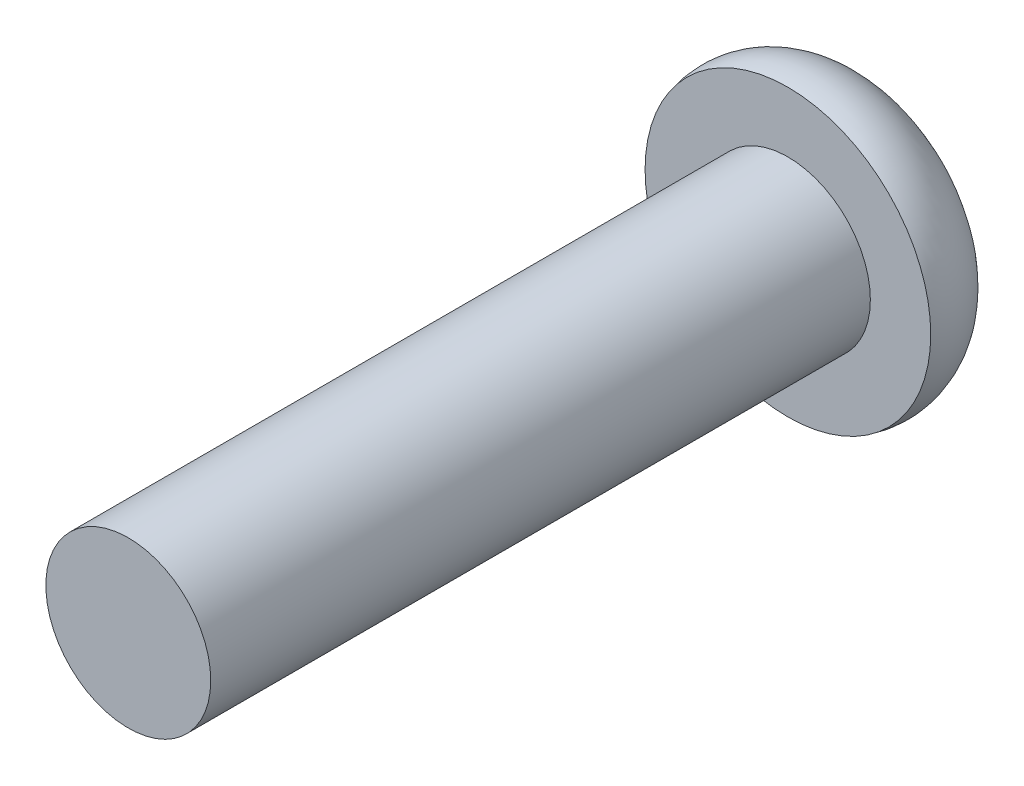
ISO-10303-21;
HEADER;
FILE_DESCRIPTION(('STEP AP214'),'2;1');
FILE_NAME('part.step','',(''),(''),'','','');
FILE_SCHEMA(('AUTOMOTIVE_DESIGN { 1 0 10303 214 1 1 1 1 }'));
ENDSEC;
DATA;
#1=APPLICATION_CONTEXT('core data for automotive mechanical design processes');
#2=APPLICATION_PROTOCOL_DEFINITION('international standard','automotive_design',2000,#1);
#3=PRODUCT_CONTEXT('',#1,'mechanical');
#4=PRODUCT('Part','Part','',(#3));
#5=PRODUCT_RELATED_PRODUCT_CATEGORY('part','',(#4));
#6=PRODUCT_DEFINITION_FORMATION('','',#4);
#7=PRODUCT_DEFINITION_CONTEXT('part definition',#1,'design');
#8=PRODUCT_DEFINITION('design','',#6,#7);
#9=PRODUCT_DEFINITION_SHAPE('','',#8);
#10=(LENGTH_UNIT() NAMED_UNIT(*) SI_UNIT(.MILLI.,.METRE.));
#11=(NAMED_UNIT(*) PLANE_ANGLE_UNIT() SI_UNIT($,.RADIAN.));
#12=(NAMED_UNIT(*) SI_UNIT($,.STERADIAN.) SOLID_ANGLE_UNIT());
#13=UNCERTAINTY_MEASURE_WITH_UNIT(LENGTH_MEASURE(1.E-05),#10,'distance_accuracy_value','');
#14=(GEOMETRIC_REPRESENTATION_CONTEXT(3) GLOBAL_UNCERTAINTY_ASSIGNED_CONTEXT((#13)) GLOBAL_UNIT_ASSIGNED_CONTEXT((#10,
#11,#12)) REPRESENTATION_CONTEXT('',''));
#15=CARTESIAN_POINT('',(0.,0.,0.));
#16=DIRECTION('',(0.,0.,1.));
#17=DIRECTION('',(1.,0.,0.));
#18=AXIS2_PLACEMENT_3D('',#15,#16,#17);
#19=CARTESIAN_POINT('',(0.,0.,0.));
#20=DIRECTION('',(0.,0.,-1.));
#21=DIRECTION('',(-1.,0.,0.));
#22=AXIS2_PLACEMENT_3D('',#19,#20,#21);
#23=PLANE('',#22);
#24=CARTESIAN_POINT('',(0.,0.,0.));
#25=DIRECTION('',(0.,0.,1.));
#26=DIRECTION('',(1.,0.,0.));
#27=AXIS2_PLACEMENT_3D('',#24,#25,#26);
#28=CIRCLE('',#27,3.175);
#29=CARTESIAN_POINT('',(3.175,0.,0.));
#30=VERTEX_POINT('',#29);
#31=EDGE_CURVE('E11',#30,#30,#28,.T.);
#32=ORIENTED_EDGE('',*,*,#31,.T.);
#33=EDGE_LOOP('',(#32));
#34=FACE_BOUND('',#33,.T.);
#35=ADVANCED_FACE('F32',(#34),#23,.F.);
#36=CARTESIAN_POINT('',(0.,0.,0.));
#37=DIRECTION('',(0.,0.,1.));
#38=DIRECTION('',(1.,0.,0.));
#39=AXIS2_PLACEMENT_3D('',#36,#37,#38);
#40=CYLINDRICAL_SURFACE('',#39,3.175);
#41=ORIENTED_EDGE('',*,*,#31,.F.);
#42=EDGE_LOOP('',(#41));
#43=FACE_BOUND('',#42,.T.);
#44=CARTESIAN_POINT('',(0.,0.,-25.4));
#45=DIRECTION('',(0.,0.,1.));
#46=DIRECTION('',(1.,0.,0.));
#47=AXIS2_PLACEMENT_3D('',#44,#45,#46);
#48=CIRCLE('',#47,3.175);
#49=CARTESIAN_POINT('',(3.175,0.,-25.4));
#50=VERTEX_POINT('',#49);
#51=EDGE_CURVE('E39',#50,#50,#48,.T.);
#52=ORIENTED_EDGE('',*,*,#51,.T.);
#53=EDGE_LOOP('',(#52));
#54=FACE_BOUND('',#53,.T.);
#55=ADVANCED_FACE('F146',(#43,#54),#40,.T.);
#56=CARTESIAN_POINT('',(-3.175,0.,-25.4));
#57=DIRECTION('',(0.,0.,-1.));
#58=DIRECTION('',(-1.,0.,0.));
#59=AXIS2_PLACEMENT_3D('',#56,#57,#58);
#60=PLANE('',#59);
#61=ORIENTED_EDGE('',*,*,#51,.F.);
#62=EDGE_LOOP('',(#61));
#63=FACE_BOUND('',#62,.T.);
#64=CARTESIAN_POINT('',(0.,0.,-25.4));
#65=DIRECTION('',(0.,0.,1.));
#66=DIRECTION('',(1.,0.,0.));
#67=AXIS2_PLACEMENT_3D('',#64,#65,#66);
#68=CIRCLE('',#67,5.5);
#69=CARTESIAN_POINT('',(5.5,0.,-25.4));
#70=VERTEX_POINT('',#69);
#71=EDGE_CURVE('E141',#70,#70,#68,.T.);
#72=ORIENTED_EDGE('',*,*,#71,.T.);
#73=EDGE_LOOP('',(#72));
#74=FACE_BOUND('',#73,.T.);
#75=ADVANCED_FACE('F148',(#63,#74),#60,.F.);
#76=CARTESIAN_POINT('',(0.,0.,-26.0634615384615));
#77=DIRECTION('',(0.,0.,1.));
#78=DIRECTION('',(1.,0.,0.));
#79=AXIS2_PLACEMENT_3D('',#76,#77,#78);
#80=TOROIDAL_SURFACE('',#79,3.,2.58653846153846);
#81=ORIENTED_EDGE('',*,*,#71,.F.);
#82=EDGE_LOOP('',(#81));
#83=FACE_BOUND('',#82,.T.);
#84=CARTESIAN_POINT('',(0.,0.,-28.65));
#85=DIRECTION('',(0.,0.,1.));
#86=DIRECTION('',(1.,0.,0.));
#87=AXIS2_PLACEMENT_3D('',#84,#85,#86);
#88=CIRCLE('',#87,3.);
#89=CARTESIAN_POINT('',(3.,0.,-28.65));
#90=VERTEX_POINT('',#89);
#91=EDGE_CURVE('E133',#90,#90,#88,.T.);
#92=ORIENTED_EDGE('',*,*,#91,.T.);
#93=EDGE_LOOP('',(#92));
#94=FACE_BOUND('',#93,.T.);
#95=ADVANCED_FACE('F151',(#83,#94),#80,.T.);
#96=CARTESIAN_POINT('',(-3.,0.,-28.65));
#97=DIRECTION('',(0.,0.,1.));
#98=DIRECTION('',(1.,0.,0.));
#99=AXIS2_PLACEMENT_3D('',#96,#97,#98);
#100=PLANE('',#99);
#101=DIRECTION('',(-0.866025403784439,0.5,0.));
#102=VECTOR('',#101,1.);
#103=CARTESIAN_POINT('',(0.,-2.3094010767585,-28.65));
#104=LINE('',#103,#102);
#105=CARTESIAN_POINT('',(0.,-2.3094010767585,-28.65));
#106=VERTEX_POINT('',#105);
#107=CARTESIAN_POINT('',(-2.,-1.15470053837925,-28.65));
#108=VERTEX_POINT('',#107);
#109=EDGE_CURVE('E120',#106,#108,#104,.T.);
#110=ORIENTED_EDGE('',*,*,#109,.F.);
#111=DIRECTION('',(-0.866025403784438,-0.5,0.));
#112=VECTOR('',#111,1.);
#113=CARTESIAN_POINT('',(2.,-1.15470053837925,-28.65));
#114=LINE('',#113,#112);
#115=CARTESIAN_POINT('',(2.,-1.15470053837925,-28.65));
#116=VERTEX_POINT('',#115);
#117=EDGE_CURVE('E46',#116,#106,#114,.T.);
#118=ORIENTED_EDGE('',*,*,#117,.F.);
#119=DIRECTION('',(0.,-1.,0.));
#120=VECTOR('',#119,1.);
#121=CARTESIAN_POINT('',(2.,1.15470053837925,-28.65));
#122=LINE('',#121,#120);
#123=CARTESIAN_POINT('',(2.,1.15470053837925,-28.65));
#124=VERTEX_POINT('',#123);
#125=EDGE_CURVE('E129',#124,#116,#122,.T.);
#126=ORIENTED_EDGE('',*,*,#125,.F.);
#127=DIRECTION('',(0.866025403784439,-0.5,0.));
#128=VECTOR('',#127,1.);
#129=CARTESIAN_POINT('',(0.,2.3094010767585,-28.65));
#130=LINE('',#129,#128);
#131=CARTESIAN_POINT('',(0.,2.3094010767585,-28.65));
#132=VERTEX_POINT('',#131);
#133=EDGE_CURVE('E127',#132,#124,#130,.T.);
#134=ORIENTED_EDGE('',*,*,#133,.F.);
#135=DIRECTION('',(0.866025403784439,0.5,0.));
#136=VECTOR('',#135,1.);
#137=CARTESIAN_POINT('',(-2.,1.15470053837925,-28.65));
#138=LINE('',#137,#136);
#139=CARTESIAN_POINT('',(-2.,1.15470053837925,-28.65));
#140=VERTEX_POINT('',#139);
#141=EDGE_CURVE('E94',#140,#132,#138,.T.);
#142=ORIENTED_EDGE('',*,*,#141,.F.);
#143=DIRECTION('',(0.,1.,0.));
#144=VECTOR('',#143,1.);
#145=CARTESIAN_POINT('',(-2.,-1.15470053837925,-28.65));
#146=LINE('',#145,#144);
#147=EDGE_CURVE('E123',#108,#140,#146,.T.);
#148=ORIENTED_EDGE('',*,*,#147,.F.);
#149=EDGE_LOOP('',(#110,#118,#126,#134,#142,#148));
#150=FACE_BOUND('',#149,.T.);
#151=ORIENTED_EDGE('',*,*,#91,.F.);
#152=EDGE_LOOP('',(#151));
#153=FACE_BOUND('',#152,.T.);
#154=ADVANCED_FACE('F157',(#150,#153),#100,.F.);
#155=CARTESIAN_POINT('',(2.,-1.15470053837925,-25.4));
#156=DIRECTION('',(0.5,-0.866025403784438,0.));
#157=DIRECTION('',(0.866025403784439,0.5,0.));
#158=AXIS2_PLACEMENT_3D('',#155,#156,#157);
#159=PLANE('',#158);
#160=ORIENTED_EDGE('',*,*,#117,.T.);
#161=DIRECTION('',(0.,0.,-1.));
#162=VECTOR('',#161,1.);
#163=CARTESIAN_POINT('',(0.,-2.3094010767585,-25.4));
#164=LINE('',#163,#162);
#165=CARTESIAN_POINT('',(0.,-2.3094010767585,-25.4));
#166=VERTEX_POINT('',#165);
#167=EDGE_CURVE('E76',#166,#106,#164,.T.);
#168=ORIENTED_EDGE('',*,*,#167,.F.);
#169=DIRECTION('',(-0.866025403784438,-0.5,0.));
#170=VECTOR('',#169,1.);
#171=CARTESIAN_POINT('',(2.,-1.15470053837925,-25.4));
#172=LINE('',#171,#170);
#173=CARTESIAN_POINT('',(2.,-1.15470053837925,-25.4));
#174=VERTEX_POINT('',#173);
#175=EDGE_CURVE('E131',#174,#166,#172,.T.);
#176=ORIENTED_EDGE('',*,*,#175,.F.);
#177=DIRECTION('',(0.,0.,-1.));
#178=VECTOR('',#177,1.);
#179=CARTESIAN_POINT('',(2.,-1.15470053837925,-25.4));
#180=LINE('',#179,#178);
#181=EDGE_CURVE('E54',#174,#116,#180,.T.);
#182=ORIENTED_EDGE('',*,*,#181,.T.);
#183=EDGE_LOOP('',(#160,#168,#176,#182));
#184=FACE_BOUND('',#183,.T.);
#185=ADVANCED_FACE('F162',(#184),#159,.F.);
#186=CARTESIAN_POINT('',(2.,1.15470053837925,-25.4));
#187=DIRECTION('',(1.,0.,0.));
#188=DIRECTION('',(0.,1.,0.));
#189=AXIS2_PLACEMENT_3D('',#186,#187,#188);
#190=PLANE('',#189);
#191=ORIENTED_EDGE('',*,*,#125,.T.);
#192=ORIENTED_EDGE('',*,*,#181,.F.);
#193=DIRECTION('',(0.,-1.,0.));
#194=VECTOR('',#193,1.);
#195=CARTESIAN_POINT('',(2.,1.15470053837925,-25.4));
#196=LINE('',#195,#194);
#197=CARTESIAN_POINT('',(2.,1.15470053837925,-25.4));
#198=VERTEX_POINT('',#197);
#199=EDGE_CURVE('E106',#198,#174,#196,.T.);
#200=ORIENTED_EDGE('',*,*,#199,.F.);
#201=DIRECTION('',(0.,0.,-1.));
#202=VECTOR('',#201,1.);
#203=CARTESIAN_POINT('',(2.,1.15470053837925,-25.4));
#204=LINE('',#203,#202);
#205=EDGE_CURVE('E98',#198,#124,#204,.T.);
#206=ORIENTED_EDGE('',*,*,#205,.T.);
#207=EDGE_LOOP('',(#191,#192,#200,#206));
#208=FACE_BOUND('',#207,.T.);
#209=ADVANCED_FACE('F168',(#208),#190,.F.);
#210=CARTESIAN_POINT('',(0.,2.3094010767585,-25.4));
#211=DIRECTION('',(0.5,0.866025403784439,0.));
#212=DIRECTION('',(-0.866025403784439,0.5,0.));
#213=AXIS2_PLACEMENT_3D('',#210,#211,#212);
#214=PLANE('',#213);
#215=ORIENTED_EDGE('',*,*,#133,.T.);
#216=ORIENTED_EDGE('',*,*,#205,.F.);
#217=DIRECTION('',(0.866025403784439,-0.5,0.));
#218=VECTOR('',#217,1.);
#219=CARTESIAN_POINT('',(0.,2.3094010767585,-25.4));
#220=LINE('',#219,#218);
#221=CARTESIAN_POINT('',(0.,2.3094010767585,-25.4));
#222=VERTEX_POINT('',#221);
#223=EDGE_CURVE('E102',#222,#198,#220,.T.);
#224=ORIENTED_EDGE('',*,*,#223,.F.);
#225=DIRECTION('',(0.,0.,-1.));
#226=VECTOR('',#225,1.);
#227=CARTESIAN_POINT('',(0.,2.3094010767585,-25.4));
#228=LINE('',#227,#226);
#229=EDGE_CURVE('E87',#222,#132,#228,.T.);
#230=ORIENTED_EDGE('',*,*,#229,.T.);
#231=EDGE_LOOP('',(#215,#216,#224,#230));
#232=FACE_BOUND('',#231,.T.);
#233=ADVANCED_FACE('F103',(#232),#214,.F.);
#234=CARTESIAN_POINT('',(-2.,1.15470053837925,-25.4));
#235=DIRECTION('',(-0.5,0.866025403784438,0.));
#236=DIRECTION('',(-0.866025403784439,-0.5,0.));
#237=AXIS2_PLACEMENT_3D('',#234,#235,#236);
#238=PLANE('',#237);
#239=ORIENTED_EDGE('',*,*,#141,.T.);
#240=ORIENTED_EDGE('',*,*,#229,.F.);
#241=DIRECTION('',(0.866025403784439,0.5,0.));
#242=VECTOR('',#241,1.);
#243=CARTESIAN_POINT('',(-2.,1.15470053837925,-25.4));
#244=LINE('',#243,#242);
#245=CARTESIAN_POINT('',(-2.,1.15470053837925,-25.4));
#246=VERTEX_POINT('',#245);
#247=EDGE_CURVE('E91',#246,#222,#244,.T.);
#248=ORIENTED_EDGE('',*,*,#247,.F.);
#249=DIRECTION('',(0.,0.,-1.));
#250=VECTOR('',#249,1.);
#251=CARTESIAN_POINT('',(-2.,1.15470053837925,-25.4));
#252=LINE('',#251,#250);
#253=EDGE_CURVE('E99',#246,#140,#252,.T.);
#254=ORIENTED_EDGE('',*,*,#253,.T.);
#255=EDGE_LOOP('',(#239,#240,#248,#254));
#256=FACE_BOUND('',#255,.T.);
#257=ADVANCED_FACE('F89',(#256),#238,.F.);
#258=CARTESIAN_POINT('',(-2.,-1.15470053837925,-25.4));
#259=DIRECTION('',(-1.,0.,0.));
#260=DIRECTION('',(0.,-1.,0.));
#261=AXIS2_PLACEMENT_3D('',#258,#259,#260);
#262=PLANE('',#261);
#263=ORIENTED_EDGE('',*,*,#147,.T.);
#264=ORIENTED_EDGE('',*,*,#253,.F.);
#265=DIRECTION('',(0.,1.,0.));
#266=VECTOR('',#265,1.);
#267=CARTESIAN_POINT('',(-2.,-1.15470053837925,-25.4));
#268=LINE('',#267,#266);
#269=CARTESIAN_POINT('',(-2.,-1.15470053837925,-25.4));
#270=VERTEX_POINT('',#269);
#271=EDGE_CURVE('E112',#270,#246,#268,.T.);
#272=ORIENTED_EDGE('',*,*,#271,.F.);
#273=DIRECTION('',(0.,0.,-1.));
#274=VECTOR('',#273,1.);
#275=CARTESIAN_POINT('',(-2.,-1.15470053837925,-25.4));
#276=LINE('',#275,#274);
#277=EDGE_CURVE('E136',#270,#108,#276,.T.);
#278=ORIENTED_EDGE('',*,*,#277,.T.);
#279=EDGE_LOOP('',(#263,#264,#272,#278));
#280=FACE_BOUND('',#279,.T.);
#281=ADVANCED_FACE('F223',(#280),#262,.F.);
#282=CARTESIAN_POINT('',(0.,-2.3094010767585,-25.4));
#283=DIRECTION('',(-0.5,-0.866025403784439,0.));
#284=DIRECTION('',(0.866025403784439,-0.5,0.));
#285=AXIS2_PLACEMENT_3D('',#282,#283,#284);
#286=PLANE('',#285);
#287=ORIENTED_EDGE('',*,*,#109,.T.);
#288=ORIENTED_EDGE('',*,*,#277,.F.);
#289=DIRECTION('',(-0.866025403784439,0.5,0.));
#290=VECTOR('',#289,1.);
#291=CARTESIAN_POINT('',(0.,-2.3094010767585,-25.4));
#292=LINE('',#291,#290);
#293=EDGE_CURVE('E114',#166,#270,#292,.T.);
#294=ORIENTED_EDGE('',*,*,#293,.F.);
#295=ORIENTED_EDGE('',*,*,#167,.T.);
#296=EDGE_LOOP('',(#287,#288,#294,#295));
#297=FACE_BOUND('',#296,.T.);
#298=ADVANCED_FACE('F232',(#297),#286,.F.);
#299=CARTESIAN_POINT('',(0.,0.,-25.4));
#300=DIRECTION('',(0.,0.,-1.));
#301=DIRECTION('',(-1.,0.,0.));
#302=AXIS2_PLACEMENT_3D('',#299,#300,#301);
#303=PLANE('',#302);
#304=ORIENTED_EDGE('',*,*,#175,.T.);
#305=ORIENTED_EDGE('',*,*,#293,.T.);
#306=ORIENTED_EDGE('',*,*,#271,.T.);
#307=ORIENTED_EDGE('',*,*,#247,.T.);
#308=ORIENTED_EDGE('',*,*,#223,.T.);
#309=ORIENTED_EDGE('',*,*,#199,.T.);
#310=EDGE_LOOP('',(#304,#305,#306,#307,#308,#309));
#311=FACE_BOUND('',#310,.T.);
#312=ADVANCED_FACE('F109',(#311),#303,.T.);
#313=CLOSED_SHELL('',(#35,#55,#75,#95,#154,#185,#209,#233,#257,#281,#298,#312));
#314=MANIFOLD_SOLID_BREP('B2',#313);
#315=ADVANCED_BREP_SHAPE_REPRESENTATION('',(#18,#314),#14);
#316=SHAPE_DEFINITION_REPRESENTATION(#9,#315);
ENDSEC;
END-ISO-10303-21;
